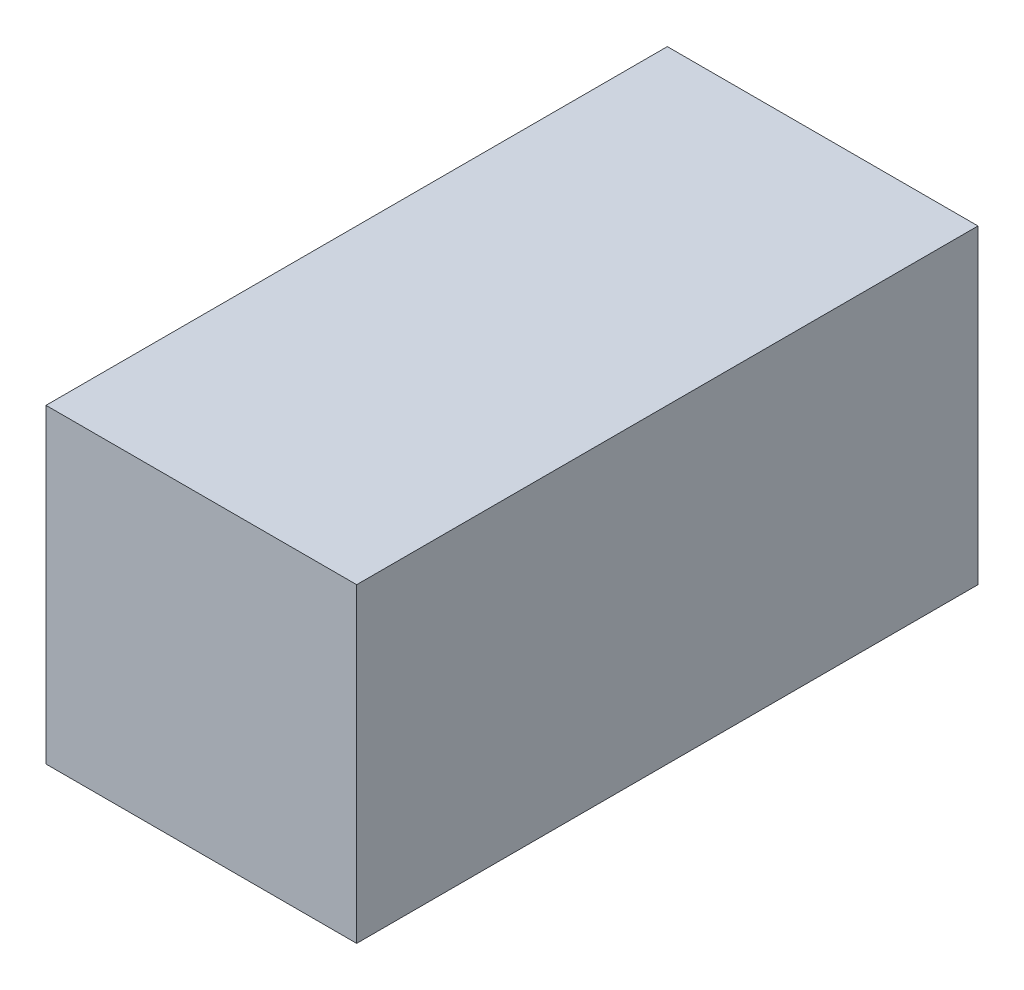
ISO-10303-21;
HEADER;
FILE_DESCRIPTION(('STEP AP214'),'2;1');
FILE_NAME('part.step','',(''),(''),'','','');
FILE_SCHEMA(('AUTOMOTIVE_DESIGN { 1 0 10303 214 1 1 1 1 }'));
ENDSEC;
DATA;
#1=APPLICATION_CONTEXT('core data for automotive mechanical design processes');
#2=APPLICATION_PROTOCOL_DEFINITION('international standard','automotive_design',2000,#1);
#3=PRODUCT_CONTEXT('',#1,'mechanical');
#4=PRODUCT('Part','Part','',(#3));
#5=PRODUCT_RELATED_PRODUCT_CATEGORY('part','',(#4));
#6=PRODUCT_DEFINITION_FORMATION('','',#4);
#7=PRODUCT_DEFINITION_CONTEXT('part definition',#1,'design');
#8=PRODUCT_DEFINITION('design','',#6,#7);
#9=PRODUCT_DEFINITION_SHAPE('','',#8);
#10=(LENGTH_UNIT() NAMED_UNIT(*) SI_UNIT(.MILLI.,.METRE.));
#11=(NAMED_UNIT(*) PLANE_ANGLE_UNIT() SI_UNIT($,.RADIAN.));
#12=(NAMED_UNIT(*) SI_UNIT($,.STERADIAN.) SOLID_ANGLE_UNIT());
#13=UNCERTAINTY_MEASURE_WITH_UNIT(LENGTH_MEASURE(1.E-05),#10,'distance_accuracy_value','');
#14=(GEOMETRIC_REPRESENTATION_CONTEXT(3) GLOBAL_UNCERTAINTY_ASSIGNED_CONTEXT((#13)) GLOBAL_UNIT_ASSIGNED_CONTEXT((#10,
#11,#12)) REPRESENTATION_CONTEXT('',''));
#15=CARTESIAN_POINT('',(0.,0.,0.));
#16=DIRECTION('',(0.,0.,1.));
#17=DIRECTION('',(1.,0.,0.));
#18=AXIS2_PLACEMENT_3D('',#15,#16,#17);
#19=CARTESIAN_POINT('',(0.,0.,40.));
#20=DIRECTION('',(1.,0.,0.));
#21=DIRECTION('',(0.,0.,-1.));
#22=AXIS2_PLACEMENT_3D('',#19,#20,#21);
#23=PLANE('',#22);
#24=DIRECTION('',(0.,-1.,0.));
#25=VECTOR('',#24,1.);
#26=CARTESIAN_POINT('',(0.,0.,0.));
#27=LINE('',#26,#25);
#28=CARTESIAN_POINT('',(0.,20.,0.));
#29=VERTEX_POINT('',#28);
#30=CARTESIAN_POINT('',(0.,0.,0.));
#31=VERTEX_POINT('',#30);
#32=EDGE_CURVE('E96',#29,#31,#27,.T.);
#33=ORIENTED_EDGE('',*,*,#32,.T.);
#34=DIRECTION('',(0.,0.,-1.));
#35=VECTOR('',#34,1.);
#36=CARTESIAN_POINT('',(0.,0.,40.));
#37=LINE('',#36,#35);
#38=CARTESIAN_POINT('',(0.,0.,40.));
#39=VERTEX_POINT('',#38);
#40=EDGE_CURVE('E11',#39,#31,#37,.T.);
#41=ORIENTED_EDGE('',*,*,#40,.F.);
#42=DIRECTION('',(0.,-1.,0.));
#43=VECTOR('',#42,1.);
#44=CARTESIAN_POINT('',(0.,0.,40.));
#45=LINE('',#44,#43);
#46=CARTESIAN_POINT('',(0.,20.,40.));
#47=VERTEX_POINT('',#46);
#48=EDGE_CURVE('E84',#47,#39,#45,.T.);
#49=ORIENTED_EDGE('',*,*,#48,.F.);
#50=DIRECTION('',(0.,0.,-1.));
#51=VECTOR('',#50,1.);
#52=CARTESIAN_POINT('',(0.,20.,40.));
#53=LINE('',#52,#51);
#54=EDGE_CURVE('E92',#47,#29,#53,.T.);
#55=ORIENTED_EDGE('',*,*,#54,.T.);
#56=EDGE_LOOP('',(#33,#41,#49,#55));
#57=FACE_BOUND('',#56,.T.);
#58=ADVANCED_FACE('F33',(#57),#23,.F.);
#59=CARTESIAN_POINT('',(0.,0.,40.));
#60=DIRECTION('',(0.,1.,0.));
#61=DIRECTION('',(0.,0.,1.));
#62=AXIS2_PLACEMENT_3D('',#59,#60,#61);
#63=PLANE('',#62);
#64=DIRECTION('',(1.,0.,0.));
#65=VECTOR('',#64,1.);
#66=CARTESIAN_POINT('',(0.,0.,0.));
#67=LINE('',#66,#65);
#68=CARTESIAN_POINT('',(20.,0.,0.));
#69=VERTEX_POINT('',#68);
#70=EDGE_CURVE('E88',#31,#69,#67,.T.);
#71=ORIENTED_EDGE('',*,*,#70,.T.);
#72=DIRECTION('',(0.,0.,-1.));
#73=VECTOR('',#72,1.);
#74=CARTESIAN_POINT('',(20.,0.,40.));
#75=LINE('',#74,#73);
#76=CARTESIAN_POINT('',(20.,0.,40.));
#77=VERTEX_POINT('',#76);
#78=EDGE_CURVE('E41',#77,#69,#75,.T.);
#79=ORIENTED_EDGE('',*,*,#78,.F.);
#80=DIRECTION('',(1.,0.,0.));
#81=VECTOR('',#80,1.);
#82=CARTESIAN_POINT('',(0.,0.,40.));
#83=LINE('',#82,#81);
#84=EDGE_CURVE('E79',#39,#77,#83,.T.);
#85=ORIENTED_EDGE('',*,*,#84,.F.);
#86=ORIENTED_EDGE('',*,*,#40,.T.);
#87=EDGE_LOOP('',(#71,#79,#85,#86));
#88=FACE_BOUND('',#87,.T.);
#89=ADVANCED_FACE('F87',(#88),#63,.F.);
#90=CARTESIAN_POINT('',(20.,0.,40.));
#91=DIRECTION('',(-1.,0.,0.));
#92=DIRECTION('',(0.,-1.,0.));
#93=AXIS2_PLACEMENT_3D('',#90,#91,#92);
#94=PLANE('',#93);
#95=DIRECTION('',(0.,1.,0.));
#96=VECTOR('',#95,1.);
#97=CARTESIAN_POINT('',(20.,0.,0.));
#98=LINE('',#97,#96);
#99=CARTESIAN_POINT('',(20.,20.,0.));
#100=VERTEX_POINT('',#99);
#101=EDGE_CURVE('E66',#69,#100,#98,.T.);
#102=ORIENTED_EDGE('',*,*,#101,.T.);
#103=DIRECTION('',(0.,0.,-1.));
#104=VECTOR('',#103,1.);
#105=CARTESIAN_POINT('',(20.,20.,40.));
#106=LINE('',#105,#104);
#107=CARTESIAN_POINT('',(20.,20.,40.));
#108=VERTEX_POINT('',#107);
#109=EDGE_CURVE('E89',#108,#100,#106,.T.);
#110=ORIENTED_EDGE('',*,*,#109,.F.);
#111=DIRECTION('',(0.,1.,0.));
#112=VECTOR('',#111,1.);
#113=CARTESIAN_POINT('',(20.,0.,40.));
#114=LINE('',#113,#112);
#115=EDGE_CURVE('E82',#77,#108,#114,.T.);
#116=ORIENTED_EDGE('',*,*,#115,.F.);
#117=ORIENTED_EDGE('',*,*,#78,.T.);
#118=EDGE_LOOP('',(#102,#110,#116,#117));
#119=FACE_BOUND('',#118,.T.);
#120=ADVANCED_FACE('F90',(#119),#94,.F.);
#121=CARTESIAN_POINT('',(0.,20.,40.));
#122=DIRECTION('',(0.,-1.,0.));
#123=DIRECTION('',(0.,0.,-1.));
#124=AXIS2_PLACEMENT_3D('',#121,#122,#123);
#125=PLANE('',#124);
#126=DIRECTION('',(-1.,0.,0.));
#127=VECTOR('',#126,1.);
#128=CARTESIAN_POINT('',(0.,20.,0.));
#129=LINE('',#128,#127);
#130=EDGE_CURVE('E72',#100,#29,#129,.T.);
#131=ORIENTED_EDGE('',*,*,#130,.T.);
#132=ORIENTED_EDGE('',*,*,#54,.F.);
#133=DIRECTION('',(-1.,0.,0.));
#134=VECTOR('',#133,1.);
#135=CARTESIAN_POINT('',(0.,20.,40.));
#136=LINE('',#135,#134);
#137=EDGE_CURVE('E49',#108,#47,#136,.T.);
#138=ORIENTED_EDGE('',*,*,#137,.F.);
#139=ORIENTED_EDGE('',*,*,#109,.T.);
#140=EDGE_LOOP('',(#131,#132,#138,#139));
#141=FACE_BOUND('',#140,.T.);
#142=ADVANCED_FACE('F103',(#141),#125,.F.);
#143=CARTESIAN_POINT('',(0.,0.,40.));
#144=DIRECTION('',(0.,0.,-1.));
#145=DIRECTION('',(-1.,0.,0.));
#146=AXIS2_PLACEMENT_3D('',#143,#144,#145);
#147=PLANE('',#146);
#148=ORIENTED_EDGE('',*,*,#48,.T.);
#149=ORIENTED_EDGE('',*,*,#84,.T.);
#150=ORIENTED_EDGE('',*,*,#115,.T.);
#151=ORIENTED_EDGE('',*,*,#137,.T.);
#152=EDGE_LOOP('',(#148,#149,#150,#151));
#153=FACE_BOUND('',#152,.T.);
#154=ADVANCED_FACE('F80',(#153),#147,.F.);
#155=CARTESIAN_POINT('',(0.,0.,0.));
#156=DIRECTION('',(0.,0.,-1.));
#157=DIRECTION('',(-1.,0.,0.));
#158=AXIS2_PLACEMENT_3D('',#155,#156,#157);
#159=PLANE('',#158);
#160=ORIENTED_EDGE('',*,*,#32,.F.);
#161=ORIENTED_EDGE('',*,*,#130,.F.);
#162=ORIENTED_EDGE('',*,*,#101,.F.);
#163=ORIENTED_EDGE('',*,*,#70,.F.);
#164=EDGE_LOOP('',(#160,#161,#162,#163));
#165=FACE_BOUND('',#164,.T.);
#166=ADVANCED_FACE('F106',(#165),#159,.T.);
#167=CLOSED_SHELL('',(#58,#89,#120,#142,#154,#166));
#168=MANIFOLD_SOLID_BREP('B2',#167);
#169=ADVANCED_BREP_SHAPE_REPRESENTATION('',(#18,#168),#14);
#170=SHAPE_DEFINITION_REPRESENTATION(#9,#169);
ENDSEC;
END-ISO-10303-21;
